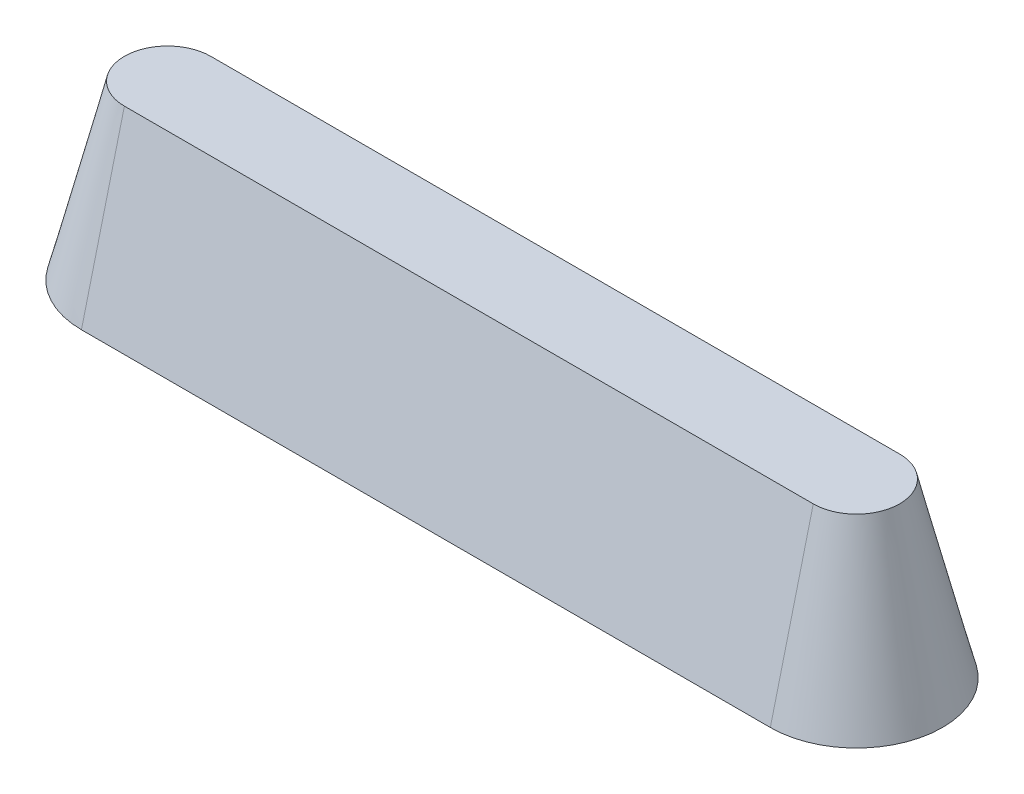
ISO-10303-21;
HEADER;
FILE_DESCRIPTION(('STEP AP214'),'2;1');
FILE_NAME('part.step','',(''),(''),'','','');
FILE_SCHEMA(('AUTOMOTIVE_DESIGN { 1 0 10303 214 1 1 1 1 }'));
ENDSEC;
DATA;
#1=APPLICATION_CONTEXT('core data for automotive mechanical design processes');
#2=APPLICATION_PROTOCOL_DEFINITION('international standard','automotive_design',2000,#1);
#3=PRODUCT_CONTEXT('',#1,'mechanical');
#4=PRODUCT('Part','Part','',(#3));
#5=PRODUCT_RELATED_PRODUCT_CATEGORY('part','',(#4));
#6=PRODUCT_DEFINITION_FORMATION('','',#4);
#7=PRODUCT_DEFINITION_CONTEXT('part definition',#1,'design');
#8=PRODUCT_DEFINITION('design','',#6,#7);
#9=PRODUCT_DEFINITION_SHAPE('','',#8);
#10=(LENGTH_UNIT() NAMED_UNIT(*) SI_UNIT(.MILLI.,.METRE.));
#11=(NAMED_UNIT(*) PLANE_ANGLE_UNIT() SI_UNIT($,.RADIAN.));
#12=(NAMED_UNIT(*) SI_UNIT($,.STERADIAN.) SOLID_ANGLE_UNIT());
#13=UNCERTAINTY_MEASURE_WITH_UNIT(LENGTH_MEASURE(1.E-05),#10,'distance_accuracy_value','');
#14=(GEOMETRIC_REPRESENTATION_CONTEXT(3) GLOBAL_UNCERTAINTY_ASSIGNED_CONTEXT((#13)) GLOBAL_UNIT_ASSIGNED_CONTEXT((#10,
#11,#12)) REPRESENTATION_CONTEXT('',''));
#15=CARTESIAN_POINT('',(0.,0.,0.));
#16=DIRECTION('',(0.,0.,1.));
#17=DIRECTION('',(1.,0.,0.));
#18=AXIS2_PLACEMENT_3D('',#15,#16,#17);
#19=CARTESIAN_POINT('',(-157.142857142857,0.,0.));
#20=DIRECTION('',(0.,-1.,0.));
#21=DIRECTION('',(0.,0.,1.));
#22=AXIS2_PLACEMENT_3D('',#19,#20,#21);
#23=CONICAL_SURFACE('',#22,15.,0.244346095279207);
#24=CARTESIAN_POINT('',(-157.142857142857,0.,0.));
#25=DIRECTION('',(0.,1.,0.));
#26=DIRECTION('',(0.,0.,1.));
#27=AXIS2_PLACEMENT_3D('',#24,#25,#26);
#28=CIRCLE('',#27,15.);
#29=CARTESIAN_POINT('',(-157.142857142857,0.,-15.));
#30=VERTEX_POINT('',#29);
#31=CARTESIAN_POINT('',(-157.142857142857,0.,15.));
#32=VERTEX_POINT('',#31);
#33=EDGE_CURVE('E82',#30,#32,#28,.T.);
#34=ORIENTED_EDGE('',*,*,#33,.T.);
#35=DIRECTION('',(0.,-0.970295726275996,0.241921895599668));
#36=VECTOR('',#35,1.);
#37=CARTESIAN_POINT('',(-157.142857142857,0.,15.));
#38=LINE('',#37,#36);
#39=CARTESIAN_POINT('',(-157.142857142857,30.,7.52015991470456));
#40=VERTEX_POINT('',#39);
#41=EDGE_CURVE('E11',#40,#32,#38,.T.);
#42=ORIENTED_EDGE('',*,*,#41,.F.);
#43=CARTESIAN_POINT('',(-157.142857142857,30.,0.));
#44=DIRECTION('',(0.,1.,0.));
#45=DIRECTION('',(0.,0.,1.));
#46=AXIS2_PLACEMENT_3D('',#43,#44,#45);
#47=CIRCLE('',#46,7.52015991470456);
#48=CARTESIAN_POINT('',(-157.142857142857,30.,-7.52015991470456));
#49=VERTEX_POINT('',#48);
#50=EDGE_CURVE('E98',#49,#40,#47,.T.);
#51=ORIENTED_EDGE('',*,*,#50,.F.);
#52=DIRECTION('',(0.,-0.970295726275996,-0.241921895599668));
#53=VECTOR('',#52,1.);
#54=CARTESIAN_POINT('',(-157.142857142857,0.,-15.));
#55=LINE('',#54,#53);
#56=EDGE_CURVE('E93',#49,#30,#55,.T.);
#57=ORIENTED_EDGE('',*,*,#56,.T.);
#58=EDGE_LOOP('',(#34,#42,#51,#57));
#59=FACE_BOUND('',#58,.T.);
#60=ADVANCED_FACE('F36',(#59),#23,.T.);
#61=CARTESIAN_POINT('',(-157.142857142857,0.,15.));
#62=DIRECTION('',(0.,0.241921895599668,0.970295726275996));
#63=DIRECTION('',(0.,-0.970295726275996,0.241921895599668));
#64=AXIS2_PLACEMENT_3D('',#61,#62,#63);
#65=PLANE('',#64);
#66=DIRECTION('',(1.,0.,0.));
#67=VECTOR('',#66,1.);
#68=CARTESIAN_POINT('',(-157.142857142857,0.,15.));
#69=LINE('',#68,#67);
#70=CARTESIAN_POINT('',(-37.142857142857,0.,15.));
#71=VERTEX_POINT('',#70);
#72=EDGE_CURVE('E78',#32,#71,#69,.T.);
#73=ORIENTED_EDGE('',*,*,#72,.T.);
#74=DIRECTION('',(0.,-0.970295726275996,0.241921895599668));
#75=VECTOR('',#74,1.);
#76=CARTESIAN_POINT('',(-37.142857142857,0.,15.));
#77=LINE('',#76,#75);
#78=CARTESIAN_POINT('',(-37.142857142857,30.,7.52015991470456));
#79=VERTEX_POINT('',#78);
#80=EDGE_CURVE('E45',#79,#71,#77,.T.);
#81=ORIENTED_EDGE('',*,*,#80,.F.);
#82=DIRECTION('',(-1.,0.,0.));
#83=VECTOR('',#82,1.);
#84=CARTESIAN_POINT('',(-157.142857142857,30.,7.52015991470456));
#85=LINE('',#84,#83);
#86=EDGE_CURVE('E89',#40,#79,#85,.F.);
#87=ORIENTED_EDGE('',*,*,#86,.F.);
#88=ORIENTED_EDGE('',*,*,#41,.T.);
#89=EDGE_LOOP('',(#73,#81,#87,#88));
#90=FACE_BOUND('',#89,.T.);
#91=ADVANCED_FACE('F38',(#90),#65,.T.);
#92=CARTESIAN_POINT('',(-37.142857142857,0.,0.));
#93=DIRECTION('',(0.,-1.,0.));
#94=DIRECTION('',(0.,0.,1.));
#95=AXIS2_PLACEMENT_3D('',#92,#93,#94);
#96=CONICAL_SURFACE('',#95,15.,0.244346095279207);
#97=CARTESIAN_POINT('',(-37.142857142857,0.,0.));
#98=DIRECTION('',(0.,1.,0.));
#99=DIRECTION('',(0.,0.,1.));
#100=AXIS2_PLACEMENT_3D('',#97,#98,#99);
#101=CIRCLE('',#100,15.);
#102=CARTESIAN_POINT('',(-37.142857142857,0.,-15.));
#103=VERTEX_POINT('',#102);
#104=EDGE_CURVE('E83',#71,#103,#101,.T.);
#105=ORIENTED_EDGE('',*,*,#104,.T.);
#106=DIRECTION('',(0.,-0.970295726275996,-0.241921895599668));
#107=VECTOR('',#106,1.);
#108=CARTESIAN_POINT('',(-37.142857142857,0.,-15.));
#109=LINE('',#108,#107);
#110=CARTESIAN_POINT('',(-37.142857142857,30.,-7.52015991470456));
#111=VERTEX_POINT('',#110);
#112=EDGE_CURVE('E101',#111,#103,#109,.T.);
#113=ORIENTED_EDGE('',*,*,#112,.F.);
#114=CARTESIAN_POINT('',(-37.142857142857,30.,0.));
#115=DIRECTION('',(0.,1.,0.));
#116=DIRECTION('',(0.,0.,1.));
#117=AXIS2_PLACEMENT_3D('',#114,#115,#116);
#118=CIRCLE('',#117,7.52015991470456);
#119=EDGE_CURVE('E57',#79,#111,#118,.T.);
#120=ORIENTED_EDGE('',*,*,#119,.F.);
#121=ORIENTED_EDGE('',*,*,#80,.T.);
#122=EDGE_LOOP('',(#105,#113,#120,#121));
#123=FACE_BOUND('',#122,.T.);
#124=ADVANCED_FACE('F108',(#123),#96,.T.);
#125=CARTESIAN_POINT('',(-157.142857142857,0.,-15.));
#126=DIRECTION('',(0.,0.241921895599668,-0.970295726275996));
#127=DIRECTION('',(0.,0.970295726275996,0.241921895599668));
#128=AXIS2_PLACEMENT_3D('',#125,#126,#127);
#129=PLANE('',#128);
#130=DIRECTION('',(-1.,0.,0.));
#131=VECTOR('',#130,1.);
#132=CARTESIAN_POINT('',(-157.142857142857,0.,-15.));
#133=LINE('',#132,#131);
#134=EDGE_CURVE('E97',#103,#30,#133,.T.);
#135=ORIENTED_EDGE('',*,*,#134,.T.);
#136=ORIENTED_EDGE('',*,*,#56,.F.);
#137=DIRECTION('',(1.,0.,0.));
#138=VECTOR('',#137,1.);
#139=CARTESIAN_POINT('',(-157.142857142857,30.,-7.52015991470456));
#140=LINE('',#139,#138);
#141=EDGE_CURVE('E40',#111,#49,#140,.F.);
#142=ORIENTED_EDGE('',*,*,#141,.F.);
#143=ORIENTED_EDGE('',*,*,#112,.T.);
#144=EDGE_LOOP('',(#135,#136,#142,#143));
#145=FACE_BOUND('',#144,.T.);
#146=ADVANCED_FACE('F110',(#145),#129,.T.);
#147=CARTESIAN_POINT('',(-157.142857142857,30.,0.));
#148=DIRECTION('',(0.,1.,0.));
#149=DIRECTION('',(0.,0.,1.));
#150=AXIS2_PLACEMENT_3D('',#147,#148,#149);
#151=PLANE('',#150);
#152=ORIENTED_EDGE('',*,*,#50,.T.);
#153=ORIENTED_EDGE('',*,*,#86,.T.);
#154=ORIENTED_EDGE('',*,*,#119,.T.);
#155=ORIENTED_EDGE('',*,*,#141,.T.);
#156=EDGE_LOOP('',(#152,#153,#154,#155));
#157=FACE_BOUND('',#156,.T.);
#158=ADVANCED_FACE('F106',(#157),#151,.T.);
#159=CARTESIAN_POINT('',(-157.142857142857,0.,0.));
#160=DIRECTION('',(0.,1.,0.));
#161=DIRECTION('',(0.,0.,1.));
#162=AXIS2_PLACEMENT_3D('',#159,#160,#161);
#163=PLANE('',#162);
#164=ORIENTED_EDGE('',*,*,#33,.F.);
#165=ORIENTED_EDGE('',*,*,#134,.F.);
#166=ORIENTED_EDGE('',*,*,#104,.F.);
#167=ORIENTED_EDGE('',*,*,#72,.F.);
#168=EDGE_LOOP('',(#164,#165,#166,#167));
#169=FACE_BOUND('',#168,.T.);
#170=ADVANCED_FACE('F79',(#169),#163,.F.);
#171=CLOSED_SHELL('',(#60,#91,#124,#146,#158,#170));
#172=MANIFOLD_SOLID_BREP('B2',#171);
#173=ADVANCED_BREP_SHAPE_REPRESENTATION('',(#18,#172),#14);
#174=SHAPE_DEFINITION_REPRESENTATION(#9,#173);
ENDSEC;
END-ISO-10303-21;
